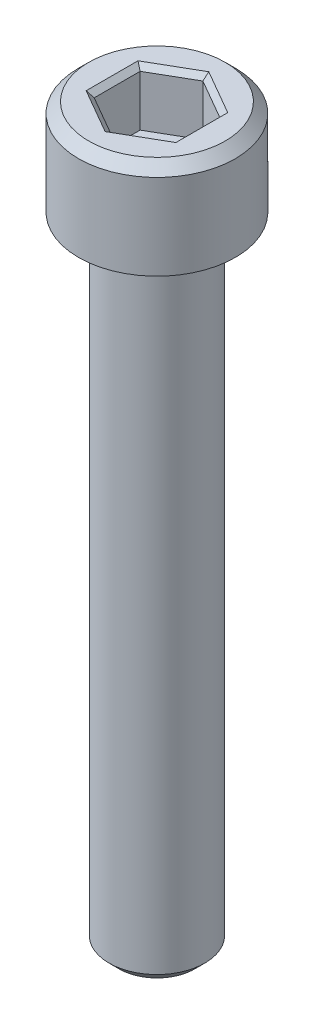
ISO-10303-21;
HEADER;
FILE_DESCRIPTION(('STEP AP214'),'2;1');
FILE_NAME('part.step','',(''),(''),'','','');
FILE_SCHEMA(('AUTOMOTIVE_DESIGN { 1 0 10303 214 1 1 1 1 }'));
ENDSEC;
DATA;
#1=APPLICATION_CONTEXT('core data for automotive mechanical design processes');
#2=APPLICATION_PROTOCOL_DEFINITION('international standard','automotive_design',2000,#1);
#3=PRODUCT_CONTEXT('',#1,'mechanical');
#4=PRODUCT('Part','Part','',(#3));
#5=PRODUCT_RELATED_PRODUCT_CATEGORY('part','',(#4));
#6=PRODUCT_DEFINITION_FORMATION('','',#4);
#7=PRODUCT_DEFINITION_CONTEXT('part definition',#1,'design');
#8=PRODUCT_DEFINITION('design','',#6,#7);
#9=PRODUCT_DEFINITION_SHAPE('','',#8);
#10=(LENGTH_UNIT() NAMED_UNIT(*) SI_UNIT(.MILLI.,.METRE.));
#11=(NAMED_UNIT(*) PLANE_ANGLE_UNIT() SI_UNIT($,.RADIAN.));
#12=(NAMED_UNIT(*) SI_UNIT($,.STERADIAN.) SOLID_ANGLE_UNIT());
#13=UNCERTAINTY_MEASURE_WITH_UNIT(LENGTH_MEASURE(1.E-05),#10,'distance_accuracy_value','');
#14=(GEOMETRIC_REPRESENTATION_CONTEXT(3) GLOBAL_UNCERTAINTY_ASSIGNED_CONTEXT((#13)) GLOBAL_UNIT_ASSIGNED_CONTEXT((#10,
#11,#12)) REPRESENTATION_CONTEXT('',''));
#15=CARTESIAN_POINT('',(0.,0.,0.));
#16=DIRECTION('',(0.,0.,1.));
#17=DIRECTION('',(1.,0.,0.));
#18=AXIS2_PLACEMENT_3D('',#15,#16,#17);
#19=CARTESIAN_POINT('',(-1.984375,-2.794,2.291358881));
#20=DIRECTION('',(0.,-1.,0.));
#21=DIRECTION('',(0.,0.,-1.));
#22=AXIS2_PLACEMENT_3D('',#19,#20,#21);
#23=PLANE('',#22);
#24=DIRECTION('',(0.86602540367543,0.,0.500000000188808));
#25=VECTOR('',#24,1.);
#26=CARTESIAN_POINT('',(0.9921875,-2.794,-1.7185191605));
#27=LINE('',#26,#25);
#28=CARTESIAN_POINT('',(-1.10929950121463E-09,-2.794,-2.29135888035955));
#29=VERTEX_POINT('',#28);
#30=CARTESIAN_POINT('',(1.984375,-2.794,-1.14567944025));
#31=VERTEX_POINT('',#30);
#32=EDGE_CURVE('E77',#29,#31,#27,.T.);
#33=ORIENTED_EDGE('',*,*,#32,.F.);
#34=DIRECTION('',(0.86602540367543,0.,-0.500000000188808));
#35=VECTOR('',#34,1.);
#36=CARTESIAN_POINT('',(-0.9921875,-2.794,-1.7185191605));
#37=LINE('',#36,#35);
#38=CARTESIAN_POINT('',(-1.984375,-2.794,-1.14567944025));
#39=VERTEX_POINT('',#38);
#40=EDGE_CURVE('E156',#39,#29,#37,.T.);
#41=ORIENTED_EDGE('',*,*,#40,.F.);
#42=DIRECTION('',(0.,0.,-1.));
#43=VECTOR('',#42,1.);
#44=CARTESIAN_POINT('',(-1.984375,-2.794,0.));
#45=LINE('',#44,#43);
#46=CARTESIAN_POINT('',(-1.984375,-2.794,1.14567944025));
#47=VERTEX_POINT('',#46);
#48=EDGE_CURVE('E166',#47,#39,#45,.T.);
#49=ORIENTED_EDGE('',*,*,#48,.F.);
#50=DIRECTION('',(-0.86602540367543,0.,-0.500000000188808));
#51=VECTOR('',#50,1.);
#52=CARTESIAN_POINT('',(-0.9921875,-2.794,1.7185191605));
#53=LINE('',#52,#51);
#54=CARTESIAN_POINT('',(1.10929950121463E-09,-2.794,2.29135888035955));
#55=VERTEX_POINT('',#54);
#56=EDGE_CURVE('E162',#55,#47,#53,.T.);
#57=ORIENTED_EDGE('',*,*,#56,.F.);
#58=DIRECTION('',(-0.86602540367543,0.,0.500000000188808));
#59=VECTOR('',#58,1.);
#60=CARTESIAN_POINT('',(0.9921875,-2.794,1.7185191605));
#61=LINE('',#60,#59);
#62=CARTESIAN_POINT('',(1.984375,-2.794,1.14567944025));
#63=VERTEX_POINT('',#62);
#64=EDGE_CURVE('E163',#63,#55,#61,.T.);
#65=ORIENTED_EDGE('',*,*,#64,.F.);
#66=DIRECTION('',(0.,0.,1.));
#67=VECTOR('',#66,1.);
#68=CARTESIAN_POINT('',(1.984375,-2.794,0.));
#69=LINE('',#68,#67);
#70=EDGE_CURVE('E207',#31,#63,#69,.T.);
#71=ORIENTED_EDGE('',*,*,#70,.F.);
#72=EDGE_LOOP('',(#33,#41,#49,#57,#65,#71));
#73=FACE_BOUND('',#72,.T.);
#74=ADVANCED_FACE('F17',(#73),#23,.F.);
#75=CARTESIAN_POINT('',(0.,-2.794,-2.291358881));
#76=DIRECTION('',(-0.500000000188808,0.,0.86602540367543));
#77=DIRECTION('',(0.86602540367543,0.,0.500000000188808));
#78=AXIS2_PLACEMENT_3D('',#75,#76,#77);
#79=PLANE('',#78);
#80=DIRECTION('',(0.86602540367543,0.,0.500000000188808));
#81=VECTOR('',#80,1.);
#82=CARTESIAN_POINT('',(0.,-0.253999999855026,-2.291358881));
#83=LINE('',#82,#81);
#84=CARTESIAN_POINT('',(1.98437500000621,-0.25400000005244,-1.14567943998924));
#85=VERTEX_POINT('',#84);
#86=CARTESIAN_POINT('',(0.,-0.253999999643648,-2.291358881));
#87=VERTEX_POINT('',#86);
#88=EDGE_CURVE('E21',#85,#87,#83,.F.);
#89=ORIENTED_EDGE('',*,*,#88,.T.);
#90=DIRECTION('',(0.,1.,0.));
#91=VECTOR('',#90,1.);
#92=CARTESIAN_POINT('',(0.,-1.524,-2.291358881));
#93=LINE('',#92,#91);
#94=EDGE_CURVE('E153',#29,#87,#93,.T.);
#95=ORIENTED_EDGE('',*,*,#94,.F.);
#96=ORIENTED_EDGE('',*,*,#32,.T.);
#97=DIRECTION('',(0.,-1.,0.));
#98=VECTOR('',#97,1.);
#99=CARTESIAN_POINT('',(1.984375,-1.524,-1.14567944));
#100=LINE('',#99,#98);
#101=EDGE_CURVE('E69',#85,#31,#100,.T.);
#102=ORIENTED_EDGE('',*,*,#101,.F.);
#103=EDGE_LOOP('',(#89,#95,#96,#102));
#104=FACE_BOUND('',#103,.T.);
#105=ADVANCED_FACE('F194',(#104),#79,.T.);
#106=CARTESIAN_POINT('',(1.984375,-2.794,-1.14567944));
#107=DIRECTION('',(-1.,0.,0.));
#108=DIRECTION('',(0.,0.,1.));
#109=AXIS2_PLACEMENT_3D('',#106,#107,#108);
#110=PLANE('',#109);
#111=DIRECTION('',(0.,0.,-1.));
#112=VECTOR('',#111,1.);
#113=CARTESIAN_POINT('',(1.984375,-0.254,0.));
#114=LINE('',#113,#112);
#115=CARTESIAN_POINT('',(1.984375,-0.25399999994252,1.1456794403978));
#116=VERTEX_POINT('',#115);
#117=EDGE_CURVE('E141',#116,#85,#114,.T.);
#118=ORIENTED_EDGE('',*,*,#117,.T.);
#119=ORIENTED_EDGE('',*,*,#101,.T.);
#120=ORIENTED_EDGE('',*,*,#70,.T.);
#121=DIRECTION('',(0.,-1.,0.));
#122=VECTOR('',#121,1.);
#123=CARTESIAN_POINT('',(1.984375,-1.524,1.14567944));
#124=LINE('',#123,#122);
#125=EDGE_CURVE('E159',#116,#63,#124,.T.);
#126=ORIENTED_EDGE('',*,*,#125,.F.);
#127=EDGE_LOOP('',(#118,#119,#120,#126));
#128=FACE_BOUND('',#127,.T.);
#129=ADVANCED_FACE('F209',(#128),#110,.T.);
#130=CARTESIAN_POINT('',(1.984375,-2.794,1.14567944));
#131=DIRECTION('',(-0.500000000188808,0.,-0.86602540367543));
#132=DIRECTION('',(-0.86602540367543,0.,0.500000000188808));
#133=AXIS2_PLACEMENT_3D('',#130,#131,#132);
#134=PLANE('',#133);
#135=DIRECTION('',(-0.86602540367543,0.,0.500000000188808));
#136=VECTOR('',#135,1.);
#137=CARTESIAN_POINT('',(1.984375,-0.253999999885039,1.14567944));
#138=LINE('',#137,#136);
#139=CARTESIAN_POINT('',(0.,-0.253999999643648,2.291358881));
#140=VERTEX_POINT('',#139);
#141=EDGE_CURVE('E104',#140,#116,#138,.F.);
#142=ORIENTED_EDGE('',*,*,#141,.T.);
#143=ORIENTED_EDGE('',*,*,#125,.T.);
#144=ORIENTED_EDGE('',*,*,#64,.T.);
#145=DIRECTION('',(0.,-1.,0.));
#146=VECTOR('',#145,1.);
#147=CARTESIAN_POINT('',(0.,-1.524,2.291358881));
#148=LINE('',#147,#146);
#149=EDGE_CURVE('E164',#140,#55,#148,.T.);
#150=ORIENTED_EDGE('',*,*,#149,.F.);
#151=EDGE_LOOP('',(#142,#143,#144,#150));
#152=FACE_BOUND('',#151,.T.);
#153=ADVANCED_FACE('F211',(#152),#134,.T.);
#154=CARTESIAN_POINT('',(0.,-2.794,2.291358881));
#155=DIRECTION('',(0.500000000188808,0.,-0.86602540367543));
#156=DIRECTION('',(-0.86602540367543,0.,-0.500000000188808));
#157=AXIS2_PLACEMENT_3D('',#154,#155,#156);
#158=PLANE('',#157);
#159=DIRECTION('',(-0.86602540367543,0.,-0.500000000188808));
#160=VECTOR('',#159,1.);
#161=CARTESIAN_POINT('',(0.,-0.253999999885039,2.291358881));
#162=LINE('',#161,#160);
#163=CARTESIAN_POINT('',(-1.98437500000621,-0.254000000067447,1.14567943998924));
#164=VERTEX_POINT('',#163);
#165=EDGE_CURVE('E108',#164,#140,#162,.F.);
#166=ORIENTED_EDGE('',*,*,#165,.T.);
#167=ORIENTED_EDGE('',*,*,#149,.T.);
#168=ORIENTED_EDGE('',*,*,#56,.T.);
#169=DIRECTION('',(0.,-1.,0.));
#170=VECTOR('',#169,1.);
#171=CARTESIAN_POINT('',(-1.984375,-1.524,1.14567944));
#172=LINE('',#171,#170);
#173=EDGE_CURVE('E168',#164,#47,#172,.T.);
#174=ORIENTED_EDGE('',*,*,#173,.F.);
#175=EDGE_LOOP('',(#166,#167,#168,#174));
#176=FACE_BOUND('',#175,.T.);
#177=ADVANCED_FACE('F253',(#176),#158,.T.);
#178=CARTESIAN_POINT('',(-1.984375,-2.794,1.14567944));
#179=DIRECTION('',(1.,0.,0.));
#180=DIRECTION('',(0.,0.,-1.));
#181=AXIS2_PLACEMENT_3D('',#178,#179,#180);
#182=PLANE('',#181);
#183=DIRECTION('',(0.,0.,1.));
#184=VECTOR('',#183,1.);
#185=CARTESIAN_POINT('',(-1.984375,-0.254,0.));
#186=LINE('',#185,#184);
#187=CARTESIAN_POINT('',(-1.984375,-0.25399999994252,-1.1456794403978));
#188=VERTEX_POINT('',#187);
#189=EDGE_CURVE('E107',#188,#164,#186,.T.);
#190=ORIENTED_EDGE('',*,*,#189,.T.);
#191=ORIENTED_EDGE('',*,*,#173,.T.);
#192=ORIENTED_EDGE('',*,*,#48,.T.);
#193=DIRECTION('',(0.,-1.,0.));
#194=VECTOR('',#193,1.);
#195=CARTESIAN_POINT('',(-1.984375,-1.524,-1.14567944));
#196=LINE('',#195,#194);
#197=EDGE_CURVE('E149',#188,#39,#196,.T.);
#198=ORIENTED_EDGE('',*,*,#197,.F.);
#199=EDGE_LOOP('',(#190,#191,#192,#198));
#200=FACE_BOUND('',#199,.T.);
#201=ADVANCED_FACE('F256',(#200),#182,.T.);
#202=CARTESIAN_POINT('',(-1.984375,-2.794,-1.14567944));
#203=DIRECTION('',(0.500000000188808,0.,0.86602540367543));
#204=DIRECTION('',(0.86602540367543,0.,-0.500000000188808));
#205=AXIS2_PLACEMENT_3D('',#202,#203,#204);
#206=PLANE('',#205);
#207=DIRECTION('',(0.86602540367543,0.,-0.500000000188808));
#208=VECTOR('',#207,1.);
#209=CARTESIAN_POINT('',(-1.984375,-0.253999999885039,-1.14567944));
#210=LINE('',#209,#208);
#211=EDGE_CURVE('E132',#87,#188,#210,.F.);
#212=ORIENTED_EDGE('',*,*,#211,.T.);
#213=ORIENTED_EDGE('',*,*,#197,.T.);
#214=ORIENTED_EDGE('',*,*,#40,.T.);
#215=ORIENTED_EDGE('',*,*,#94,.T.);
#216=EDGE_LOOP('',(#212,#213,#214,#215));
#217=FACE_BOUND('',#216,.T.);
#218=ADVANCED_FACE('F197',(#217),#206,.T.);
#219=CARTESIAN_POINT('',(0.,-0.825890071,-1.630997107));
#220=DIRECTION('',(0.353553390376765,-0.70710678144681,-0.61237243552027));
#221=DIRECTION('',(0.,0.654653670463063,-0.755928946230557));
#222=AXIS2_PLACEMENT_3D('',#219,#220,#221);
#223=PLANE('',#222);
#224=DIRECTION('',(0.866025403802823,0.,0.499999999968157));
#225=VECTOR('',#224,1.);
#226=CARTESIAN_POINT('',(0.,0.,-2.58465282041183));
#227=LINE('',#226,#225);
#228=CARTESIAN_POINT('',(-1.7113160093106E-10,3.42263882708617E-10,-2.58465281991782));
#229=VERTEX_POINT('',#228);
#230=CARTESIAN_POINT('',(2.2383750023355,2.94313306906969E-10,-1.29232640980022));
#231=VERTEX_POINT('',#230);
#232=EDGE_CURVE('E125',#229,#231,#227,.T.);
#233=ORIENTED_EDGE('',*,*,#232,.F.);
#234=DIRECTION('',(0.,-0.654653670463063,0.755928946230557));
#235=VECTOR('',#234,1.);
#236=CARTESIAN_POINT('',(0.,-0.4104821425,-2.110668866));
#237=LINE('',#236,#235);
#238=EDGE_CURVE('E130',#229,#87,#237,.T.);
#239=ORIENTED_EDGE('',*,*,#238,.T.);
#240=ORIENTED_EDGE('',*,*,#88,.F.);
#241=DIRECTION('',(0.65465367055619,0.654653670554601,-0.377964473537784));
#242=VECTOR('',#241,1.);
#243=CARTESIAN_POINT('',(1.98437500009156,-0.254000000183128,-1.1456794399955));
#244=LINE('',#243,#242);
#245=EDGE_CURVE('E140',#85,#231,#244,.T.);
#246=ORIENTED_EDGE('',*,*,#245,.T.);
#247=EDGE_LOOP('',(#233,#239,#240,#246));
#248=FACE_BOUND('',#247,.T.);
#249=ADVANCED_FACE('F193',(#248),#223,.F.);
#250=CARTESIAN_POINT('',(1.984375,-0.254,-1.307834326));
#251=DIRECTION('',(0.707106781186548,-0.707106781186547,0.));
#252=DIRECTION('',(0.707106781186547,0.707106781186548,0.));
#253=AXIS2_PLACEMENT_3D('',#250,#251,#252);
#254=PLANE('',#253);
#255=DIRECTION('',(0.,0.,1.));
#256=VECTOR('',#255,1.);
#257=CARTESIAN_POINT('',(2.23837500262981,0.,0.));
#258=LINE('',#257,#256);
#259=CARTESIAN_POINT('',(2.23837500202673,2.84730369165022E-10,1.29232641022533));
#260=VERTEX_POINT('',#259);
#261=EDGE_CURVE('E123',#231,#260,#258,.T.);
#262=ORIENTED_EDGE('',*,*,#261,.F.);
#263=ORIENTED_EDGE('',*,*,#245,.F.);
#264=ORIENTED_EDGE('',*,*,#117,.F.);
#265=DIRECTION('',(0.654653670756285,0.654653670756286,0.377964472841883));
#266=VECTOR('',#265,1.);
#267=CARTESIAN_POINT('',(1.98437499962207,-0.254000000377931,1.1456794405774));
#268=LINE('',#267,#266);
#269=EDGE_CURVE('E138',#116,#260,#268,.T.);
#270=ORIENTED_EDGE('',*,*,#269,.T.);
#271=EDGE_LOOP('',(#262,#263,#264,#270));
#272=FACE_BOUND('',#271,.T.);
#273=ADVANCED_FACE('F213',(#272),#254,.F.);
#274=CARTESIAN_POINT('',(0.,0.004925786,2.590340625));
#275=DIRECTION('',(0.353553390376765,-0.70710678144681,0.61237243552027));
#276=DIRECTION('',(0.,-0.654653670463063,-0.755928946230557));
#277=AXIS2_PLACEMENT_3D('',#274,#275,#276);
#278=PLANE('',#277);
#279=DIRECTION('',(-0.866025403802823,0.,0.499999999968157));
#280=VECTOR('',#279,1.);
#281=CARTESIAN_POINT('',(2.23837500262982,0.,1.29232641020592));
#282=LINE('',#281,#280);
#283=CARTESIAN_POINT('',(-1.71131756705855E-10,3.4226405889147E-10,2.58465281991782));
#284=VERTEX_POINT('',#283);
#285=EDGE_CURVE('E101',#260,#284,#282,.T.);
#286=ORIENTED_EDGE('',*,*,#285,.F.);
#287=ORIENTED_EDGE('',*,*,#269,.F.);
#288=ORIENTED_EDGE('',*,*,#141,.F.);
#289=DIRECTION('',(0.,0.654653670463063,0.755928946230557));
#290=VECTOR('',#289,1.);
#291=CARTESIAN_POINT('',(0.,-0.4104821425,2.110668866));
#292=LINE('',#291,#290);
#293=EDGE_CURVE('E96',#140,#284,#292,.T.);
#294=ORIENTED_EDGE('',*,*,#293,.T.);
#295=EDGE_LOOP('',(#286,#287,#288,#294));
#296=FACE_BOUND('',#295,.T.);
#297=ADVANCED_FACE('F98',(#296),#278,.F.);
#298=CARTESIAN_POINT('',(-2.25180525,0.648298714,2.033163325));
#299=DIRECTION('',(-0.353553390376765,-0.707106781446811,0.61237243552027));
#300=DIRECTION('',(0.,-0.654653670463063,-0.755928946230557));
#301=AXIS2_PLACEMENT_3D('',#298,#299,#300);
#302=PLANE('',#301);
#303=ORIENTED_EDGE('',*,*,#165,.F.);
#304=DIRECTION('',(-0.65465367055619,0.654653670554601,0.377964473537786));
#305=VECTOR('',#304,1.);
#306=CARTESIAN_POINT('',(-1.98437500009156,-0.254000000183128,1.1456794399955));
#307=LINE('',#306,#305);
#308=CARTESIAN_POINT('',(-2.2383750023355,2.94313239144334E-10,1.29232640980022));
#309=VERTEX_POINT('',#308);
#310=EDGE_CURVE('E114',#164,#309,#307,.T.);
#311=ORIENTED_EDGE('',*,*,#310,.T.);
#312=DIRECTION('',(-0.866025403802823,0.,-0.499999999968158));
#313=VECTOR('',#312,1.);
#314=CARTESIAN_POINT('',(0.,0.,2.58465282041184));
#315=LINE('',#314,#313);
#316=EDGE_CURVE('E111',#284,#309,#315,.T.);
#317=ORIENTED_EDGE('',*,*,#316,.F.);
#318=ORIENTED_EDGE('',*,*,#293,.F.);
#319=EDGE_LOOP('',(#303,#311,#317,#318));
#320=FACE_BOUND('',#319,.T.);
#321=ADVANCED_FACE('F112',(#320),#302,.F.);
#322=CARTESIAN_POINT('',(-2.238375,0.,-1.307834326));
#323=DIRECTION('',(-0.707106781186548,-0.707106781186547,0.));
#324=DIRECTION('',(0.707106781186547,-0.707106781186548,0.));
#325=AXIS2_PLACEMENT_3D('',#322,#323,#324);
#326=PLANE('',#325);
#327=ORIENTED_EDGE('',*,*,#189,.F.);
#328=DIRECTION('',(-0.654653670756286,0.654653670756286,-0.377964472841882));
#329=VECTOR('',#328,1.);
#330=CARTESIAN_POINT('',(-1.98437499962207,-0.254000000377931,-1.1456794405774));
#331=LINE('',#330,#329);
#332=CARTESIAN_POINT('',(-2.23837500202673,2.84730057456897E-10,-1.29232641022533));
#333=VERTEX_POINT('',#332);
#334=EDGE_CURVE('E36',#188,#333,#331,.T.);
#335=ORIENTED_EDGE('',*,*,#334,.T.);
#336=DIRECTION('',(0.,0.,-1.));
#337=VECTOR('',#336,1.);
#338=CARTESIAN_POINT('',(-2.23837500262981,0.,0.));
#339=LINE('',#338,#337);
#340=EDGE_CURVE('E117',#309,#333,#339,.T.);
#341=ORIENTED_EDGE('',*,*,#340,.F.);
#342=ORIENTED_EDGE('',*,*,#310,.F.);
#343=EDGE_LOOP('',(#327,#335,#341,#342));
#344=FACE_BOUND('',#343,.T.);
#345=ADVANCED_FACE('F294',(#344),#326,.F.);
#346=CARTESIAN_POINT('',(-2.25180525,-0.182517143,-1.073819807));
#347=DIRECTION('',(-0.353553390376765,-0.707106781446811,-0.61237243552027));
#348=DIRECTION('',(0.,0.654653670463063,-0.755928946230557));
#349=AXIS2_PLACEMENT_3D('',#346,#347,#348);
#350=PLANE('',#349);
#351=DIRECTION('',(0.866025403802823,0.,-0.499999999968158));
#352=VECTOR('',#351,1.);
#353=CARTESIAN_POINT('',(-2.23837500262981,0.,-1.29232641020592));
#354=LINE('',#353,#352);
#355=EDGE_CURVE('E174',#333,#229,#354,.T.);
#356=ORIENTED_EDGE('',*,*,#355,.F.);
#357=ORIENTED_EDGE('',*,*,#334,.F.);
#358=ORIENTED_EDGE('',*,*,#211,.F.);
#359=ORIENTED_EDGE('',*,*,#238,.F.);
#360=EDGE_LOOP('',(#356,#357,#358,#359));
#361=FACE_BOUND('',#360,.T.);
#362=ADVANCED_FACE('F191',(#361),#350,.F.);
#363=CARTESIAN_POINT('',(-3.4444432,0.,-3.4444432));
#364=DIRECTION('',(0.,1.,0.));
#365=DIRECTION('',(0.,0.,1.));
#366=AXIS2_PLACEMENT_3D('',#363,#364,#365);
#367=PLANE('',#366);
#368=ORIENTED_EDGE('',*,*,#340,.T.);
#369=ORIENTED_EDGE('',*,*,#355,.T.);
#370=ORIENTED_EDGE('',*,*,#232,.T.);
#371=ORIENTED_EDGE('',*,*,#261,.T.);
#372=ORIENTED_EDGE('',*,*,#285,.T.);
#373=ORIENTED_EDGE('',*,*,#316,.T.);
#374=EDGE_LOOP('',(#368,#369,#370,#371,#372,#373));
#375=FACE_BOUND('',#374,.T.);
#376=CARTESIAN_POINT('',(0.,0.,0.));
#377=DIRECTION('',(0.,-1.,0.));
#378=DIRECTION('',(0.,0.,-1.));
#379=AXIS2_PLACEMENT_3D('',#376,#377,#378);
#380=CIRCLE('',#379,3.4036);
#381=CARTESIAN_POINT('',(0.,0.,-3.4036));
#382=VERTEX_POINT('',#381);
#383=EDGE_CURVE('E186',#382,#382,#380,.F.);
#384=ORIENTED_EDGE('',*,*,#383,.T.);
#385=EDGE_LOOP('',(#384));
#386=FACE_BOUND('',#385,.T.);
#387=ADVANCED_FACE('F119',(#375,#386),#367,.T.);
#388=CARTESIAN_POINT('',(0.,0.,0.));
#389=DIRECTION('',(0.,-1.,0.));
#390=DIRECTION('',(0.,0.,-1.));
#391=AXIS2_PLACEMENT_3D('',#388,#389,#390);
#392=CONICAL_SURFACE('',#391,3.4036,0.785398163397448);
#393=CARTESIAN_POINT('',(0.,-0.508,0.));
#394=DIRECTION('',(0.,1.,0.));
#395=DIRECTION('',(0.,0.,1.));
#396=AXIS2_PLACEMENT_3D('',#393,#394,#395);
#397=CIRCLE('',#396,3.9116);
#398=CARTESIAN_POINT('',(0.,-0.508,3.9116));
#399=VERTEX_POINT('',#398);
#400=EDGE_CURVE('E185',#399,#399,#397,.T.);
#401=ORIENTED_EDGE('',*,*,#400,.T.);
#402=EDGE_LOOP('',(#401));
#403=FACE_BOUND('',#402,.T.);
#404=ORIENTED_EDGE('',*,*,#383,.F.);
#405=EDGE_LOOP('',(#404));
#406=FACE_BOUND('',#405,.T.);
#407=ADVANCED_FACE('F240',(#403,#406),#392,.T.);
#408=CARTESIAN_POINT('',(0.,-4.7752,0.));
#409=DIRECTION('',(0.,1.,0.));
#410=DIRECTION('',(0.,0.,1.));
#411=AXIS2_PLACEMENT_3D('',#408,#409,#410);
#412=CYLINDRICAL_SURFACE('',#411,3.9116);
#413=ORIENTED_EDGE('',*,*,#400,.F.);
#414=EDGE_LOOP('',(#413));
#415=FACE_BOUND('',#414,.T.);
#416=CARTESIAN_POINT('',(0.,-4.7752,0.));
#417=DIRECTION('',(0.,1.,0.));
#418=DIRECTION('',(0.,0.,1.));
#419=AXIS2_PLACEMENT_3D('',#416,#417,#418);
#420=CIRCLE('',#419,3.9116);
#421=CARTESIAN_POINT('',(0.,-4.7752,3.9116));
#422=VERTEX_POINT('',#421);
#423=EDGE_CURVE('E182',#422,#422,#420,.T.);
#424=ORIENTED_EDGE('',*,*,#423,.T.);
#425=EDGE_LOOP('',(#424));
#426=FACE_BOUND('',#425,.T.);
#427=ADVANCED_FACE('F236',(#415,#426),#412,.T.);
#428=CARTESIAN_POINT('',(-1.9021552,-36.5252,-1.9021552));
#429=DIRECTION('',(0.,1.,0.));
#430=DIRECTION('',(0.,0.,1.));
#431=AXIS2_PLACEMENT_3D('',#428,#429,#430);
#432=PLANE('',#431);
#433=CARTESIAN_POINT('',(0.,-36.5252,0.));
#434=DIRECTION('',(0.,1.,0.));
#435=DIRECTION('',(0.,0.,1.));
#436=AXIS2_PLACEMENT_3D('',#433,#434,#435);
#437=CIRCLE('',#436,1.87959999999997);
#438=CARTESIAN_POINT('',(0.,-36.5252,1.87959999999997));
#439=VERTEX_POINT('',#438);
#440=EDGE_CURVE('E179',#439,#439,#437,.F.);
#441=ORIENTED_EDGE('',*,*,#440,.T.);
#442=EDGE_LOOP('',(#441));
#443=FACE_BOUND('',#442,.T.);
#444=ADVANCED_FACE('F239',(#443),#432,.F.);
#445=CARTESIAN_POINT('',(-3.9585392,-4.7752,-3.9585392));
#446=DIRECTION('',(0.,1.,0.));
#447=DIRECTION('',(0.,0.,1.));
#448=AXIS2_PLACEMENT_3D('',#445,#446,#447);
#449=PLANE('',#448);
#450=CARTESIAN_POINT('',(0.,-4.7752,0.));
#451=DIRECTION('',(0.,1.,0.));
#452=DIRECTION('',(0.,0.,1.));
#453=AXIS2_PLACEMENT_3D('',#450,#451,#452);
#454=CIRCLE('',#453,2.3876);
#455=CARTESIAN_POINT('',(0.,-4.7752,2.3876));
#456=VERTEX_POINT('',#455);
#457=EDGE_CURVE('E27',#456,#456,#454,.T.);
#458=ORIENTED_EDGE('',*,*,#457,.T.);
#459=EDGE_LOOP('',(#458));
#460=FACE_BOUND('',#459,.T.);
#461=ORIENTED_EDGE('',*,*,#423,.F.);
#462=EDGE_LOOP('',(#461));
#463=FACE_BOUND('',#462,.T.);
#464=ADVANCED_FACE('F19',(#460,#463),#449,.F.);
#465=CARTESIAN_POINT('',(0.,-36.5252,0.));
#466=DIRECTION('',(0.,1.,0.));
#467=DIRECTION('',(0.,0.,1.));
#468=AXIS2_PLACEMENT_3D('',#465,#466,#467);
#469=CONICAL_SURFACE('',#468,1.8796,0.78539816339744);
#470=ORIENTED_EDGE('',*,*,#440,.F.);
#471=EDGE_LOOP('',(#470));
#472=FACE_BOUND('',#471,.T.);
#473=CARTESIAN_POINT('',(0.,-36.0172,0.));
#474=DIRECTION('',(0.,1.,0.));
#475=DIRECTION('',(0.,0.,1.));
#476=AXIS2_PLACEMENT_3D('',#473,#474,#475);
#477=CIRCLE('',#476,2.3876);
#478=CARTESIAN_POINT('',(0.,-36.0172,2.3876));
#479=VERTEX_POINT('',#478);
#480=EDGE_CURVE('E11',#479,#479,#477,.F.);
#481=ORIENTED_EDGE('',*,*,#480,.T.);
#482=EDGE_LOOP('',(#481));
#483=FACE_BOUND('',#482,.T.);
#484=ADVANCED_FACE('F225',(#472,#483),#469,.T.);
#485=CARTESIAN_POINT('',(0.,-36.0172,0.));
#486=DIRECTION('',(0.,1.,0.));
#487=DIRECTION('',(0.,0.,1.));
#488=AXIS2_PLACEMENT_3D('',#485,#486,#487);
#489=CYLINDRICAL_SURFACE('',#488,2.3876);
#490=ORIENTED_EDGE('',*,*,#457,.F.);
#491=EDGE_LOOP('',(#490));
#492=FACE_BOUND('',#491,.T.);
#493=ORIENTED_EDGE('',*,*,#480,.F.);
#494=EDGE_LOOP('',(#493));
#495=FACE_BOUND('',#494,.T.);
#496=ADVANCED_FACE('F223',(#492,#495),#489,.T.);
#497=CLOSED_SHELL('',(#74,#105,#129,#153,#177,#201,#218,#249,#273,#297,#321,#345,#362,#387,#407,
#427,#444,#464,#484,#496));
#498=MANIFOLD_SOLID_BREP('B1',#497);
#499=ADVANCED_BREP_SHAPE_REPRESENTATION('',(#18,#498),#14);
#500=SHAPE_DEFINITION_REPRESENTATION(#9,#499);
ENDSEC;
END-ISO-10303-21;
